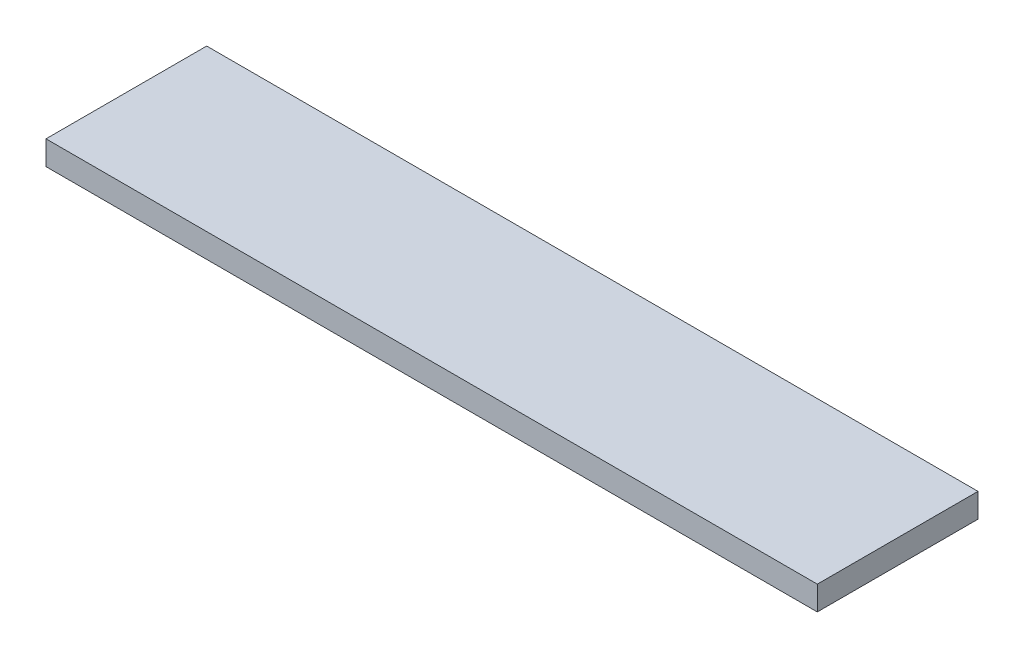
ISO-10303-21;
HEADER;
FILE_DESCRIPTION(('STEP AP214'),'2;1');
FILE_NAME('part.step','',(''),(''),'','','');
FILE_SCHEMA(('AUTOMOTIVE_DESIGN { 1 0 10303 214 1 1 1 1 }'));
ENDSEC;
DATA;
#1=APPLICATION_CONTEXT('core data for automotive mechanical design processes');
#2=APPLICATION_PROTOCOL_DEFINITION('international standard','automotive_design',2000,#1);
#3=PRODUCT_CONTEXT('',#1,'mechanical');
#4=PRODUCT('Part','Part','',(#3));
#5=PRODUCT_RELATED_PRODUCT_CATEGORY('part','',(#4));
#6=PRODUCT_DEFINITION_FORMATION('','',#4);
#7=PRODUCT_DEFINITION_CONTEXT('part definition',#1,'design');
#8=PRODUCT_DEFINITION('design','',#6,#7);
#9=PRODUCT_DEFINITION_SHAPE('','',#8);
#10=(LENGTH_UNIT() NAMED_UNIT(*) SI_UNIT(.MILLI.,.METRE.));
#11=(NAMED_UNIT(*) PLANE_ANGLE_UNIT() SI_UNIT($,.RADIAN.));
#12=(NAMED_UNIT(*) SI_UNIT($,.STERADIAN.) SOLID_ANGLE_UNIT());
#13=UNCERTAINTY_MEASURE_WITH_UNIT(LENGTH_MEASURE(1.E-05),#10,'distance_accuracy_value','');
#14=(GEOMETRIC_REPRESENTATION_CONTEXT(3) GLOBAL_UNCERTAINTY_ASSIGNED_CONTEXT((#13)) GLOBAL_UNIT_ASSIGNED_CONTEXT((#10,
#11,#12)) REPRESENTATION_CONTEXT('',''));
#15=CARTESIAN_POINT('',(0.,0.,0.));
#16=DIRECTION('',(0.,0.,1.));
#17=DIRECTION('',(1.,0.,0.));
#18=AXIS2_PLACEMENT_3D('',#15,#16,#17);
#19=CARTESIAN_POINT('',(0.,6.,0.));
#20=DIRECTION('',(1.,0.,0.));
#21=DIRECTION('',(0.,0.,-1.));
#22=AXIS2_PLACEMENT_3D('',#19,#20,#21);
#23=PLANE('',#22);
#24=DIRECTION('',(0.,0.,1.));
#25=VECTOR('',#24,1.);
#26=CARTESIAN_POINT('',(0.,0.,0.));
#27=LINE('',#26,#25);
#28=CARTESIAN_POINT('',(0.,0.,-40.));
#29=VERTEX_POINT('',#28);
#30=CARTESIAN_POINT('',(0.,0.,0.));
#31=VERTEX_POINT('',#30);
#32=EDGE_CURVE('E97',#29,#31,#27,.T.);
#33=ORIENTED_EDGE('',*,*,#32,.T.);
#34=DIRECTION('',(0.,-1.,0.));
#35=VECTOR('',#34,1.);
#36=CARTESIAN_POINT('',(0.,6.,0.));
#37=LINE('',#36,#35);
#38=CARTESIAN_POINT('',(0.,6.,0.));
#39=VERTEX_POINT('',#38);
#40=EDGE_CURVE('E11',#39,#31,#37,.T.);
#41=ORIENTED_EDGE('',*,*,#40,.F.);
#42=DIRECTION('',(0.,0.,1.));
#43=VECTOR('',#42,1.);
#44=CARTESIAN_POINT('',(0.,6.,0.));
#45=LINE('',#44,#43);
#46=CARTESIAN_POINT('',(0.,6.,-40.));
#47=VERTEX_POINT('',#46);
#48=EDGE_CURVE('E85',#47,#39,#45,.T.);
#49=ORIENTED_EDGE('',*,*,#48,.F.);
#50=DIRECTION('',(0.,-1.,0.));
#51=VECTOR('',#50,1.);
#52=CARTESIAN_POINT('',(0.,6.,-40.));
#53=LINE('',#52,#51);
#54=EDGE_CURVE('E93',#47,#29,#53,.T.);
#55=ORIENTED_EDGE('',*,*,#54,.T.);
#56=EDGE_LOOP('',(#33,#41,#49,#55));
#57=FACE_BOUND('',#56,.T.);
#58=ADVANCED_FACE('F34',(#57),#23,.F.);
#59=CARTESIAN_POINT('',(0.,6.,0.));
#60=DIRECTION('',(0.,0.,-1.));
#61=DIRECTION('',(-1.,0.,0.));
#62=AXIS2_PLACEMENT_3D('',#59,#60,#61);
#63=PLANE('',#62);
#64=DIRECTION('',(1.,0.,0.));
#65=VECTOR('',#64,1.);
#66=CARTESIAN_POINT('',(0.,0.,0.));
#67=LINE('',#66,#65);
#68=CARTESIAN_POINT('',(192.,0.,0.));
#69=VERTEX_POINT('',#68);
#70=EDGE_CURVE('E89',#31,#69,#67,.T.);
#71=ORIENTED_EDGE('',*,*,#70,.T.);
#72=DIRECTION('',(0.,-1.,0.));
#73=VECTOR('',#72,1.);
#74=CARTESIAN_POINT('',(192.,6.,0.));
#75=LINE('',#74,#73);
#76=CARTESIAN_POINT('',(192.,6.,0.));
#77=VERTEX_POINT('',#76);
#78=EDGE_CURVE('E42',#77,#69,#75,.T.);
#79=ORIENTED_EDGE('',*,*,#78,.F.);
#80=DIRECTION('',(1.,0.,0.));
#81=VECTOR('',#80,1.);
#82=CARTESIAN_POINT('',(0.,6.,0.));
#83=LINE('',#82,#81);
#84=EDGE_CURVE('E80',#39,#77,#83,.T.);
#85=ORIENTED_EDGE('',*,*,#84,.F.);
#86=ORIENTED_EDGE('',*,*,#40,.T.);
#87=EDGE_LOOP('',(#71,#79,#85,#86));
#88=FACE_BOUND('',#87,.T.);
#89=ADVANCED_FACE('F88',(#88),#63,.F.);
#90=CARTESIAN_POINT('',(192.,6.,0.));
#91=DIRECTION('',(-1.,0.,0.));
#92=DIRECTION('',(0.,0.,1.));
#93=AXIS2_PLACEMENT_3D('',#90,#91,#92);
#94=PLANE('',#93);
#95=DIRECTION('',(0.,0.,-1.));
#96=VECTOR('',#95,1.);
#97=CARTESIAN_POINT('',(192.,0.,0.));
#98=LINE('',#97,#96);
#99=CARTESIAN_POINT('',(192.,0.,-40.));
#100=VERTEX_POINT('',#99);
#101=EDGE_CURVE('E67',#69,#100,#98,.T.);
#102=ORIENTED_EDGE('',*,*,#101,.T.);
#103=DIRECTION('',(0.,-1.,0.));
#104=VECTOR('',#103,1.);
#105=CARTESIAN_POINT('',(192.,6.,-40.));
#106=LINE('',#105,#104);
#107=CARTESIAN_POINT('',(192.,6.,-40.));
#108=VERTEX_POINT('',#107);
#109=EDGE_CURVE('E90',#108,#100,#106,.T.);
#110=ORIENTED_EDGE('',*,*,#109,.F.);
#111=DIRECTION('',(0.,0.,-1.));
#112=VECTOR('',#111,1.);
#113=CARTESIAN_POINT('',(192.,6.,0.));
#114=LINE('',#113,#112);
#115=EDGE_CURVE('E83',#77,#108,#114,.T.);
#116=ORIENTED_EDGE('',*,*,#115,.F.);
#117=ORIENTED_EDGE('',*,*,#78,.T.);
#118=EDGE_LOOP('',(#102,#110,#116,#117));
#119=FACE_BOUND('',#118,.T.);
#120=ADVANCED_FACE('F91',(#119),#94,.F.);
#121=CARTESIAN_POINT('',(0.,6.,-40.));
#122=DIRECTION('',(0.,0.,1.));
#123=DIRECTION('',(1.,0.,0.));
#124=AXIS2_PLACEMENT_3D('',#121,#122,#123);
#125=PLANE('',#124);
#126=DIRECTION('',(-1.,0.,0.));
#127=VECTOR('',#126,1.);
#128=CARTESIAN_POINT('',(0.,0.,-40.));
#129=LINE('',#128,#127);
#130=EDGE_CURVE('E73',#100,#29,#129,.T.);
#131=ORIENTED_EDGE('',*,*,#130,.T.);
#132=ORIENTED_EDGE('',*,*,#54,.F.);
#133=DIRECTION('',(-1.,0.,0.));
#134=VECTOR('',#133,1.);
#135=CARTESIAN_POINT('',(0.,6.,-40.));
#136=LINE('',#135,#134);
#137=EDGE_CURVE('E50',#108,#47,#136,.T.);
#138=ORIENTED_EDGE('',*,*,#137,.F.);
#139=ORIENTED_EDGE('',*,*,#109,.T.);
#140=EDGE_LOOP('',(#131,#132,#138,#139));
#141=FACE_BOUND('',#140,.T.);
#142=ADVANCED_FACE('F104',(#141),#125,.F.);
#143=CARTESIAN_POINT('',(0.,6.,0.));
#144=DIRECTION('',(0.,-1.,0.));
#145=DIRECTION('',(0.,0.,-1.));
#146=AXIS2_PLACEMENT_3D('',#143,#144,#145);
#147=PLANE('',#146);
#148=ORIENTED_EDGE('',*,*,#48,.T.);
#149=ORIENTED_EDGE('',*,*,#84,.T.);
#150=ORIENTED_EDGE('',*,*,#115,.T.);
#151=ORIENTED_EDGE('',*,*,#137,.T.);
#152=EDGE_LOOP('',(#148,#149,#150,#151));
#153=FACE_BOUND('',#152,.T.);
#154=ADVANCED_FACE('F81',(#153),#147,.F.);
#155=CARTESIAN_POINT('',(0.,0.,0.));
#156=DIRECTION('',(0.,-1.,0.));
#157=DIRECTION('',(0.,0.,-1.));
#158=AXIS2_PLACEMENT_3D('',#155,#156,#157);
#159=PLANE('',#158);
#160=ORIENTED_EDGE('',*,*,#32,.F.);
#161=ORIENTED_EDGE('',*,*,#130,.F.);
#162=ORIENTED_EDGE('',*,*,#101,.F.);
#163=ORIENTED_EDGE('',*,*,#70,.F.);
#164=EDGE_LOOP('',(#160,#161,#162,#163));
#165=FACE_BOUND('',#164,.T.);
#166=ADVANCED_FACE('F107',(#165),#159,.T.);
#167=CLOSED_SHELL('',(#58,#89,#120,#142,#154,#166));
#168=MANIFOLD_SOLID_BREP('B2',#167);
#169=ADVANCED_BREP_SHAPE_REPRESENTATION('',(#18,#168),#14);
#170=SHAPE_DEFINITION_REPRESENTATION(#9,#169);
ENDSEC;
END-ISO-10303-21;
